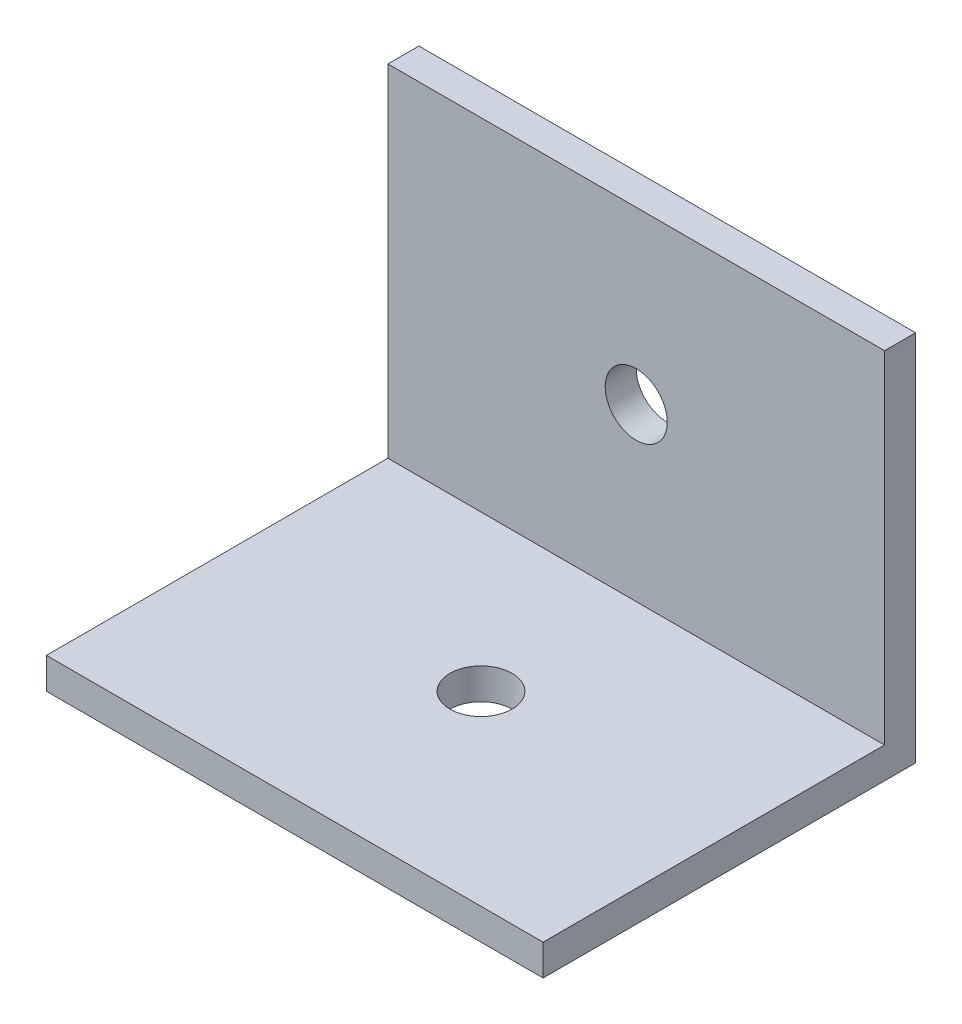
ISO-10303-21;
HEADER;
FILE_DESCRIPTION(('STEP AP214'),'2;1');
FILE_NAME('part.step','',(''),(''),'','','');
FILE_SCHEMA(('AUTOMOTIVE_DESIGN { 1 0 10303 214 1 1 1 1 }'));
ENDSEC;
DATA;
#1=APPLICATION_CONTEXT('core data for automotive mechanical design processes');
#2=APPLICATION_PROTOCOL_DEFINITION('international standard','automotive_design',2000,#1);
#3=PRODUCT_CONTEXT('',#1,'mechanical');
#4=PRODUCT('Part','Part','',(#3));
#5=PRODUCT_RELATED_PRODUCT_CATEGORY('part','',(#4));
#6=PRODUCT_DEFINITION_FORMATION('','',#4);
#7=PRODUCT_DEFINITION_CONTEXT('part definition',#1,'design');
#8=PRODUCT_DEFINITION('design','',#6,#7);
#9=PRODUCT_DEFINITION_SHAPE('','',#8);
#10=(LENGTH_UNIT() NAMED_UNIT(*) SI_UNIT(.MILLI.,.METRE.));
#11=(NAMED_UNIT(*) PLANE_ANGLE_UNIT() SI_UNIT($,.RADIAN.));
#12=(NAMED_UNIT(*) SI_UNIT($,.STERADIAN.) SOLID_ANGLE_UNIT());
#13=UNCERTAINTY_MEASURE_WITH_UNIT(LENGTH_MEASURE(1.E-05),#10,'distance_accuracy_value','');
#14=(GEOMETRIC_REPRESENTATION_CONTEXT(3) GLOBAL_UNCERTAINTY_ASSIGNED_CONTEXT((#13)) GLOBAL_UNIT_ASSIGNED_CONTEXT((#10,
#11,#12)) REPRESENTATION_CONTEXT('',''));
#15=CARTESIAN_POINT('',(0.,0.,0.));
#16=DIRECTION('',(0.,0.,1.));
#17=DIRECTION('',(1.,0.,0.));
#18=AXIS2_PLACEMENT_3D('',#15,#16,#17);
#19=CARTESIAN_POINT('',(-524.474365329743,3.175,44.45));
#20=DIRECTION('',(0.,1.,0.));
#21=DIRECTION('',(0.,0.,1.));
#22=AXIS2_PLACEMENT_3D('',#19,#20,#21);
#23=PLANE('',#22);
#24=DIRECTION('',(1.,0.,0.));
#25=VECTOR('',#24,1.);
#26=CARTESIAN_POINT('',(-524.474365329743,3.175,44.45));
#27=LINE('',#26,#25);
#28=CARTESIAN_POINT('',(-499.074365329742,3.175,44.45));
#29=VERTEX_POINT('',#28);
#30=CARTESIAN_POINT('',(-549.874365329742,3.175,44.45));
#31=VERTEX_POINT('',#30);
#32=EDGE_CURVE('E70',#29,#31,#27,.F.);
#33=ORIENTED_EDGE('',*,*,#32,.F.);
#34=DIRECTION('',(0.,0.,1.));
#35=VECTOR('',#34,1.);
#36=CARTESIAN_POINT('',(-499.074365329742,3.175,9.525));
#37=LINE('',#36,#35);
#38=CARTESIAN_POINT('',(-499.074365329742,3.175,9.525));
#39=VERTEX_POINT('',#38);
#40=EDGE_CURVE('E73',#29,#39,#37,.F.);
#41=ORIENTED_EDGE('',*,*,#40,.T.);
#42=DIRECTION('',(1.,0.,0.));
#43=VECTOR('',#42,1.);
#44=CARTESIAN_POINT('',(0.,3.17500000000001,9.525));
#45=LINE('',#44,#43);
#46=CARTESIAN_POINT('',(-549.874365329742,3.175,9.525));
#47=VERTEX_POINT('',#46);
#48=EDGE_CURVE('E64',#47,#39,#45,.T.);
#49=ORIENTED_EDGE('',*,*,#48,.F.);
#50=DIRECTION('',(0.,0.,1.));
#51=VECTOR('',#50,1.);
#52=CARTESIAN_POINT('',(-549.874365329742,3.175,9.525));
#53=LINE('',#52,#51);
#54=EDGE_CURVE('E74',#31,#47,#53,.F.);
#55=ORIENTED_EDGE('',*,*,#54,.F.);
#56=EDGE_LOOP('',(#33,#41,#49,#55));
#57=FACE_BOUND('',#56,.T.);
#58=CARTESIAN_POINT('',(-524.474365329743,3.175,25.4));
#59=DIRECTION('',(0.,1.,0.));
#60=DIRECTION('',(-1.,0.,0.));
#61=AXIS2_PLACEMENT_3D('',#58,#59,#60);
#62=CIRCLE('',#61,3.175);
#63=CARTESIAN_POINT('',(-527.649365329743,3.175,25.4));
#64=VERTEX_POINT('',#63);
#65=EDGE_CURVE('E17',#64,#64,#62,.F.);
#66=ORIENTED_EDGE('',*,*,#65,.T.);
#67=EDGE_LOOP('',(#66));
#68=FACE_BOUND('',#67,.T.);
#69=ADVANCED_FACE('F14',(#57,#68),#23,.T.);
#70=CARTESIAN_POINT('',(0.,177.8,9.525));
#71=DIRECTION('',(0.,0.,1.));
#72=DIRECTION('',(1.,0.,0.));
#73=AXIS2_PLACEMENT_3D('',#70,#71,#72);
#74=PLANE('',#73);
#75=DIRECTION('',(0.,-1.,0.));
#76=VECTOR('',#75,1.);
#77=CARTESIAN_POINT('',(-499.074365329742,19.8138542473315,9.525));
#78=LINE('',#77,#76);
#79=CARTESIAN_POINT('',(-499.074365329742,38.1,9.525));
#80=VERTEX_POINT('',#79);
#81=EDGE_CURVE('E87',#39,#80,#78,.F.);
#82=ORIENTED_EDGE('',*,*,#81,.T.);
#83=DIRECTION('',(1.,0.,0.));
#84=VECTOR('',#83,1.);
#85=CARTESIAN_POINT('',(-511.04348897934,38.1,9.525));
#86=LINE('',#85,#84);
#87=CARTESIAN_POINT('',(-549.874365329742,38.1,9.525));
#88=VERTEX_POINT('',#87);
#89=EDGE_CURVE('E122',#88,#80,#86,.T.);
#90=ORIENTED_EDGE('',*,*,#89,.F.);
#91=DIRECTION('',(0.,1.,0.));
#92=VECTOR('',#91,1.);
#93=CARTESIAN_POINT('',(-549.874365329742,19.8138542473315,9.525));
#94=LINE('',#93,#92);
#95=EDGE_CURVE('E108',#47,#88,#94,.T.);
#96=ORIENTED_EDGE('',*,*,#95,.F.);
#97=ORIENTED_EDGE('',*,*,#48,.T.);
#98=EDGE_LOOP('',(#82,#90,#96,#97));
#99=FACE_BOUND('',#98,.T.);
#100=CARTESIAN_POINT('',(-524.474365329743,20.6375,9.525));
#101=DIRECTION('',(0.,0.,-1.));
#102=DIRECTION('',(-1.,0.,0.));
#103=AXIS2_PLACEMENT_3D('',#100,#101,#102);
#104=CIRCLE('',#103,3.175);
#105=CARTESIAN_POINT('',(-527.649365329743,20.6375,9.525));
#106=VERTEX_POINT('',#105);
#107=EDGE_CURVE('E79',#106,#106,#104,.T.);
#108=ORIENTED_EDGE('',*,*,#107,.T.);
#109=EDGE_LOOP('',(#108));
#110=FACE_BOUND('',#109,.T.);
#111=ADVANCED_FACE('F124',(#99,#110),#74,.T.);
#112=CARTESIAN_POINT('',(-524.474365329743,25.4,25.4));
#113=DIRECTION('',(0.,1.,0.));
#114=DIRECTION('',(-1.,0.,0.));
#115=AXIS2_PLACEMENT_3D('',#112,#113,#114);
#116=CYLINDRICAL_SURFACE('',#115,3.175);
#117=CARTESIAN_POINT('',(-524.474365329743,0.,25.4));
#118=DIRECTION('',(0.,1.,0.));
#119=DIRECTION('',(-1.,0.,0.));
#120=AXIS2_PLACEMENT_3D('',#117,#118,#119);
#121=CIRCLE('',#120,3.175);
#122=CARTESIAN_POINT('',(-527.649365329743,0.,25.4));
#123=VERTEX_POINT('',#122);
#124=EDGE_CURVE('E101',#123,#123,#121,.T.);
#125=ORIENTED_EDGE('',*,*,#124,.F.);
#126=EDGE_LOOP('',(#125));
#127=FACE_BOUND('',#126,.T.);
#128=ORIENTED_EDGE('',*,*,#65,.F.);
#129=EDGE_LOOP('',(#128));
#130=FACE_BOUND('',#129,.T.);
#131=ADVANCED_FACE('F200',(#127,#130),#116,.F.);
#132=CARTESIAN_POINT('',(-524.474365329743,19.05,44.45));
#133=DIRECTION('',(0.,0.,1.));
#134=DIRECTION('',(1.,0.,0.));
#135=AXIS2_PLACEMENT_3D('',#132,#133,#134);
#136=PLANE('',#135);
#137=DIRECTION('',(1.,0.,0.));
#138=VECTOR('',#137,1.);
#139=CARTESIAN_POINT('',(565.15,1.04083408558608E-13,44.45));
#140=LINE('',#139,#138);
#141=CARTESIAN_POINT('',(-499.074365329742,0.,44.45));
#142=VERTEX_POINT('',#141);
#143=CARTESIAN_POINT('',(-549.874365329742,-1.00646282314303E-13,44.45));
#144=VERTEX_POINT('',#143);
#145=EDGE_CURVE('E91',#142,#144,#140,.F.);
#146=ORIENTED_EDGE('',*,*,#145,.F.);
#147=DIRECTION('',(0.,-1.,0.));
#148=VECTOR('',#147,1.);
#149=CARTESIAN_POINT('',(-499.074365329742,19.8138542473315,44.45));
#150=LINE('',#149,#148);
#151=EDGE_CURVE('E85',#142,#29,#150,.F.);
#152=ORIENTED_EDGE('',*,*,#151,.T.);
#153=ORIENTED_EDGE('',*,*,#32,.T.);
#154=DIRECTION('',(0.,1.,0.));
#155=VECTOR('',#154,1.);
#156=CARTESIAN_POINT('',(-549.874365329742,19.8138542473315,44.45));
#157=LINE('',#156,#155);
#158=EDGE_CURVE('E118',#144,#31,#157,.T.);
#159=ORIENTED_EDGE('',*,*,#158,.F.);
#160=EDGE_LOOP('',(#146,#152,#153,#159));
#161=FACE_BOUND('',#160,.T.);
#162=ADVANCED_FACE('F90',(#161),#136,.T.);
#163=CARTESIAN_POINT('',(-524.474365329743,20.6375,6.35000000000008));
#164=DIRECTION('',(0.,0.,-1.));
#165=DIRECTION('',(-1.,0.,0.));
#166=AXIS2_PLACEMENT_3D('',#163,#164,#165);
#167=CYLINDRICAL_SURFACE('',#166,3.175);
#168=ORIENTED_EDGE('',*,*,#107,.F.);
#169=EDGE_LOOP('',(#168));
#170=FACE_BOUND('',#169,.T.);
#171=CARTESIAN_POINT('',(-524.474365329743,20.6375,6.35000000000008));
#172=DIRECTION('',(0.,0.,-1.));
#173=DIRECTION('',(-1.,0.,0.));
#174=AXIS2_PLACEMENT_3D('',#171,#172,#173);
#175=CIRCLE('',#174,3.175);
#176=CARTESIAN_POINT('',(-527.649365329743,20.6375,6.35000000000008));
#177=VERTEX_POINT('',#176);
#178=EDGE_CURVE('E97',#177,#177,#175,.T.);
#179=ORIENTED_EDGE('',*,*,#178,.T.);
#180=EDGE_LOOP('',(#179));
#181=FACE_BOUND('',#180,.T.);
#182=ADVANCED_FACE('F182',(#170,#181),#167,.F.);
#183=CARTESIAN_POINT('',(-499.074365329742,19.8138542473315,9.525));
#184=DIRECTION('',(-1.,0.,0.));
#185=DIRECTION('',(0.,-1.,0.));
#186=AXIS2_PLACEMENT_3D('',#183,#184,#185);
#187=PLANE('',#186);
#188=DIRECTION('',(0.,0.,1.));
#189=VECTOR('',#188,1.);
#190=CARTESIAN_POINT('',(-499.074365329742,38.1,9.525));
#191=LINE('',#190,#189);
#192=CARTESIAN_POINT('',(-499.074365329742,38.1,6.35000000000008));
#193=VERTEX_POINT('',#192);
#194=EDGE_CURVE('E120',#80,#193,#191,.F.);
#195=ORIENTED_EDGE('',*,*,#194,.F.);
#196=ORIENTED_EDGE('',*,*,#81,.F.);
#197=ORIENTED_EDGE('',*,*,#40,.F.);
#198=ORIENTED_EDGE('',*,*,#151,.F.);
#199=DIRECTION('',(0.,0.,1.));
#200=VECTOR('',#199,1.);
#201=CARTESIAN_POINT('',(-499.074365329743,0.,9.525));
#202=LINE('',#201,#200);
#203=CARTESIAN_POINT('',(-499.074365329742,0.,6.35000000000008));
#204=VERTEX_POINT('',#203);
#205=EDGE_CURVE('E103',#204,#142,#202,.T.);
#206=ORIENTED_EDGE('',*,*,#205,.F.);
#207=DIRECTION('',(0.,1.,0.));
#208=VECTOR('',#207,1.);
#209=CARTESIAN_POINT('',(-499.074365329743,177.8,6.35000000000008));
#210=LINE('',#209,#208);
#211=EDGE_CURVE('E100',#204,#193,#210,.T.);
#212=ORIENTED_EDGE('',*,*,#211,.T.);
#213=EDGE_LOOP('',(#195,#196,#197,#198,#206,#212));
#214=FACE_BOUND('',#213,.T.);
#215=ADVANCED_FACE('F83',(#214),#187,.F.);
#216=CARTESIAN_POINT('',(-511.04348897934,38.1,9.525));
#217=DIRECTION('',(0.,1.,0.));
#218=DIRECTION('',(0.,0.,1.));
#219=AXIS2_PLACEMENT_3D('',#216,#217,#218);
#220=PLANE('',#219);
#221=ORIENTED_EDGE('',*,*,#89,.T.);
#222=ORIENTED_EDGE('',*,*,#194,.T.);
#223=DIRECTION('',(1.,0.,0.));
#224=VECTOR('',#223,1.);
#225=CARTESIAN_POINT('',(0.,38.1,6.35000000000008));
#226=LINE('',#225,#224);
#227=CARTESIAN_POINT('',(-549.874365329742,38.1,6.35000000000008));
#228=VERTEX_POINT('',#227);
#229=EDGE_CURVE('E131',#193,#228,#226,.F.);
#230=ORIENTED_EDGE('',*,*,#229,.T.);
#231=DIRECTION('',(0.,0.,1.));
#232=VECTOR('',#231,1.);
#233=CARTESIAN_POINT('',(-549.874365329742,38.1,9.525));
#234=LINE('',#233,#232);
#235=EDGE_CURVE('E104',#88,#228,#234,.F.);
#236=ORIENTED_EDGE('',*,*,#235,.F.);
#237=EDGE_LOOP('',(#221,#222,#230,#236));
#238=FACE_BOUND('',#237,.T.);
#239=ADVANCED_FACE('F130',(#238),#220,.T.);
#240=CARTESIAN_POINT('',(-549.874365329742,19.8138542473315,9.525));
#241=DIRECTION('',(-1.,0.,0.));
#242=DIRECTION('',(0.,0.,1.));
#243=AXIS2_PLACEMENT_3D('',#240,#241,#242);
#244=PLANE('',#243);
#245=ORIENTED_EDGE('',*,*,#95,.T.);
#246=ORIENTED_EDGE('',*,*,#235,.T.);
#247=DIRECTION('',(0.,1.,0.));
#248=VECTOR('',#247,1.);
#249=CARTESIAN_POINT('',(-549.874365329742,177.8,6.35000000000008));
#250=LINE('',#249,#248);
#251=CARTESIAN_POINT('',(-549.874365329742,-1.03248367528268E-13,6.35000000000008));
#252=VERTEX_POINT('',#251);
#253=EDGE_CURVE('E23',#228,#252,#250,.F.);
#254=ORIENTED_EDGE('',*,*,#253,.T.);
#255=DIRECTION('',(0.,0.,1.));
#256=VECTOR('',#255,1.);
#257=CARTESIAN_POINT('',(-549.874365329742,-1.00743244437249E-13,9.525));
#258=LINE('',#257,#256);
#259=EDGE_CURVE('E31',#144,#252,#258,.F.);
#260=ORIENTED_EDGE('',*,*,#259,.F.);
#261=ORIENTED_EDGE('',*,*,#158,.T.);
#262=ORIENTED_EDGE('',*,*,#54,.T.);
#263=EDGE_LOOP('',(#245,#246,#254,#260,#261,#262));
#264=FACE_BOUND('',#263,.T.);
#265=ADVANCED_FACE('F140',(#264),#244,.T.);
#266=CARTESIAN_POINT('',(565.15,1.04083408558608E-13,9.525));
#267=DIRECTION('',(0.,-1.,0.));
#268=DIRECTION('',(1.,0.,0.));
#269=AXIS2_PLACEMENT_3D('',#266,#267,#268);
#270=PLANE('',#269);
#271=ORIENTED_EDGE('',*,*,#145,.T.);
#272=ORIENTED_EDGE('',*,*,#259,.T.);
#273=DIRECTION('',(1.,0.,0.));
#274=VECTOR('',#273,1.);
#275=CARTESIAN_POINT('',(0.,-1.11022302462516E-13,6.35000000000008));
#276=LINE('',#275,#274);
#277=EDGE_CURVE('E9',#252,#204,#276,.T.);
#278=ORIENTED_EDGE('',*,*,#277,.T.);
#279=ORIENTED_EDGE('',*,*,#205,.T.);
#280=EDGE_LOOP('',(#271,#272,#278,#279));
#281=FACE_BOUND('',#280,.T.);
#282=ORIENTED_EDGE('',*,*,#124,.T.);
#283=EDGE_LOOP('',(#282));
#284=FACE_BOUND('',#283,.T.);
#285=ADVANCED_FACE('F139',(#281,#284),#270,.T.);
#286=CARTESIAN_POINT('',(0.,177.8,6.35000000000008));
#287=DIRECTION('',(0.,0.,1.));
#288=DIRECTION('',(1.,0.,0.));
#289=AXIS2_PLACEMENT_3D('',#286,#287,#288);
#290=PLANE('',#289);
#291=ORIENTED_EDGE('',*,*,#253,.F.);
#292=ORIENTED_EDGE('',*,*,#229,.F.);
#293=ORIENTED_EDGE('',*,*,#211,.F.);
#294=ORIENTED_EDGE('',*,*,#277,.F.);
#295=EDGE_LOOP('',(#291,#292,#293,#294));
#296=FACE_BOUND('',#295,.T.);
#297=ORIENTED_EDGE('',*,*,#178,.F.);
#298=EDGE_LOOP('',(#297));
#299=FACE_BOUND('',#298,.T.);
#300=ADVANCED_FACE('F133',(#296,#299),#290,.F.);
#301=CLOSED_SHELL('',(#69,#111,#131,#162,#182,#215,#239,#265,#285,#300));
#302=MANIFOLD_SOLID_BREP('B1',#301);
#303=ADVANCED_BREP_SHAPE_REPRESENTATION('',(#18,#302),#14);
#304=SHAPE_DEFINITION_REPRESENTATION(#9,#303);
ENDSEC;
END-ISO-10303-21;
